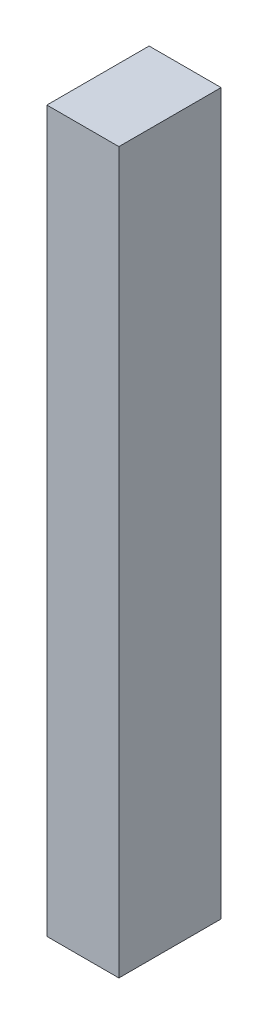
ISO-10303-21;
HEADER;
FILE_DESCRIPTION(('STEP AP214'),'2;1');
FILE_NAME('part.step','',(''),(''),'','','');
FILE_SCHEMA(('AUTOMOTIVE_DESIGN { 1 0 10303 214 1 1 1 1 }'));
ENDSEC;
DATA;
#1=APPLICATION_CONTEXT('core data for automotive mechanical design processes');
#2=APPLICATION_PROTOCOL_DEFINITION('international standard','automotive_design',2000,#1);
#3=PRODUCT_CONTEXT('',#1,'mechanical');
#4=PRODUCT('Part','Part','',(#3));
#5=PRODUCT_RELATED_PRODUCT_CATEGORY('part','',(#4));
#6=PRODUCT_DEFINITION_FORMATION('','',#4);
#7=PRODUCT_DEFINITION_CONTEXT('part definition',#1,'design');
#8=PRODUCT_DEFINITION('design','',#6,#7);
#9=PRODUCT_DEFINITION_SHAPE('','',#8);
#10=(LENGTH_UNIT() NAMED_UNIT(*) SI_UNIT(.MILLI.,.METRE.));
#11=(NAMED_UNIT(*) PLANE_ANGLE_UNIT() SI_UNIT($,.RADIAN.));
#12=(NAMED_UNIT(*) SI_UNIT($,.STERADIAN.) SOLID_ANGLE_UNIT());
#13=UNCERTAINTY_MEASURE_WITH_UNIT(LENGTH_MEASURE(1.E-05),#10,'distance_accuracy_value','');
#14=(GEOMETRIC_REPRESENTATION_CONTEXT(3) GLOBAL_UNCERTAINTY_ASSIGNED_CONTEXT((#13)) GLOBAL_UNIT_ASSIGNED_CONTEXT((#10,
#11,#12)) REPRESENTATION_CONTEXT('',''));
#15=CARTESIAN_POINT('',(0.,0.,0.));
#16=DIRECTION('',(0.,0.,1.));
#17=DIRECTION('',(1.,0.,0.));
#18=AXIS2_PLACEMENT_3D('',#15,#16,#17);
#19=CARTESIAN_POINT('',(0.,0.,28.4));
#20=DIRECTION('',(1.,0.,0.));
#21=DIRECTION('',(0.,0.,-1.));
#22=AXIS2_PLACEMENT_3D('',#19,#20,#21);
#23=PLANE('',#22);
#24=DIRECTION('',(0.,-1.,0.));
#25=VECTOR('',#24,1.);
#26=CARTESIAN_POINT('',(0.,0.,0.));
#27=LINE('',#26,#25);
#28=CARTESIAN_POINT('',(0.,200.,0.));
#29=VERTEX_POINT('',#28);
#30=CARTESIAN_POINT('',(0.,0.,0.));
#31=VERTEX_POINT('',#30);
#32=EDGE_CURVE('E96',#29,#31,#27,.T.);
#33=ORIENTED_EDGE('',*,*,#32,.T.);
#34=DIRECTION('',(0.,0.,-1.));
#35=VECTOR('',#34,1.);
#36=CARTESIAN_POINT('',(0.,0.,28.4));
#37=LINE('',#36,#35);
#38=CARTESIAN_POINT('',(0.,0.,28.4));
#39=VERTEX_POINT('',#38);
#40=EDGE_CURVE('E11',#39,#31,#37,.T.);
#41=ORIENTED_EDGE('',*,*,#40,.F.);
#42=DIRECTION('',(0.,-1.,0.));
#43=VECTOR('',#42,1.);
#44=CARTESIAN_POINT('',(0.,0.,28.4));
#45=LINE('',#44,#43);
#46=CARTESIAN_POINT('',(0.,200.,28.4));
#47=VERTEX_POINT('',#46);
#48=EDGE_CURVE('E84',#47,#39,#45,.T.);
#49=ORIENTED_EDGE('',*,*,#48,.F.);
#50=DIRECTION('',(0.,0.,-1.));
#51=VECTOR('',#50,1.);
#52=CARTESIAN_POINT('',(0.,200.,28.4));
#53=LINE('',#52,#51);
#54=EDGE_CURVE('E92',#47,#29,#53,.T.);
#55=ORIENTED_EDGE('',*,*,#54,.T.);
#56=EDGE_LOOP('',(#33,#41,#49,#55));
#57=FACE_BOUND('',#56,.T.);
#58=ADVANCED_FACE('F33',(#57),#23,.F.);
#59=CARTESIAN_POINT('',(0.,0.,28.4));
#60=DIRECTION('',(0.,1.,0.));
#61=DIRECTION('',(0.,0.,1.));
#62=AXIS2_PLACEMENT_3D('',#59,#60,#61);
#63=PLANE('',#62);
#64=DIRECTION('',(1.,0.,0.));
#65=VECTOR('',#64,1.);
#66=CARTESIAN_POINT('',(0.,0.,0.));
#67=LINE('',#66,#65);
#68=CARTESIAN_POINT('',(20.,0.,0.));
#69=VERTEX_POINT('',#68);
#70=EDGE_CURVE('E88',#31,#69,#67,.T.);
#71=ORIENTED_EDGE('',*,*,#70,.T.);
#72=DIRECTION('',(0.,0.,-1.));
#73=VECTOR('',#72,1.);
#74=CARTESIAN_POINT('',(20.,0.,28.4));
#75=LINE('',#74,#73);
#76=CARTESIAN_POINT('',(20.,0.,28.4));
#77=VERTEX_POINT('',#76);
#78=EDGE_CURVE('E41',#77,#69,#75,.T.);
#79=ORIENTED_EDGE('',*,*,#78,.F.);
#80=DIRECTION('',(1.,0.,0.));
#81=VECTOR('',#80,1.);
#82=CARTESIAN_POINT('',(0.,0.,28.4));
#83=LINE('',#82,#81);
#84=EDGE_CURVE('E79',#39,#77,#83,.T.);
#85=ORIENTED_EDGE('',*,*,#84,.F.);
#86=ORIENTED_EDGE('',*,*,#40,.T.);
#87=EDGE_LOOP('',(#71,#79,#85,#86));
#88=FACE_BOUND('',#87,.T.);
#89=ADVANCED_FACE('F87',(#88),#63,.F.);
#90=CARTESIAN_POINT('',(20.,0.,28.4));
#91=DIRECTION('',(-1.,0.,0.));
#92=DIRECTION('',(0.,0.,1.));
#93=AXIS2_PLACEMENT_3D('',#90,#91,#92);
#94=PLANE('',#93);
#95=DIRECTION('',(0.,1.,0.));
#96=VECTOR('',#95,1.);
#97=CARTESIAN_POINT('',(20.,0.,0.));
#98=LINE('',#97,#96);
#99=CARTESIAN_POINT('',(20.,200.,0.));
#100=VERTEX_POINT('',#99);
#101=EDGE_CURVE('E66',#69,#100,#98,.T.);
#102=ORIENTED_EDGE('',*,*,#101,.T.);
#103=DIRECTION('',(0.,0.,-1.));
#104=VECTOR('',#103,1.);
#105=CARTESIAN_POINT('',(20.,200.,28.4));
#106=LINE('',#105,#104);
#107=CARTESIAN_POINT('',(20.,200.,28.4));
#108=VERTEX_POINT('',#107);
#109=EDGE_CURVE('E89',#108,#100,#106,.T.);
#110=ORIENTED_EDGE('',*,*,#109,.F.);
#111=DIRECTION('',(0.,1.,0.));
#112=VECTOR('',#111,1.);
#113=CARTESIAN_POINT('',(20.,0.,28.4));
#114=LINE('',#113,#112);
#115=EDGE_CURVE('E82',#77,#108,#114,.T.);
#116=ORIENTED_EDGE('',*,*,#115,.F.);
#117=ORIENTED_EDGE('',*,*,#78,.T.);
#118=EDGE_LOOP('',(#102,#110,#116,#117));
#119=FACE_BOUND('',#118,.T.);
#120=ADVANCED_FACE('F90',(#119),#94,.F.);
#121=CARTESIAN_POINT('',(0.,200.,28.4));
#122=DIRECTION('',(0.,-1.,0.));
#123=DIRECTION('',(0.,0.,-1.));
#124=AXIS2_PLACEMENT_3D('',#121,#122,#123);
#125=PLANE('',#124);
#126=DIRECTION('',(-1.,0.,0.));
#127=VECTOR('',#126,1.);
#128=CARTESIAN_POINT('',(0.,200.,0.));
#129=LINE('',#128,#127);
#130=EDGE_CURVE('E72',#100,#29,#129,.T.);
#131=ORIENTED_EDGE('',*,*,#130,.T.);
#132=ORIENTED_EDGE('',*,*,#54,.F.);
#133=DIRECTION('',(-1.,0.,0.));
#134=VECTOR('',#133,1.);
#135=CARTESIAN_POINT('',(0.,200.,28.4));
#136=LINE('',#135,#134);
#137=EDGE_CURVE('E49',#108,#47,#136,.T.);
#138=ORIENTED_EDGE('',*,*,#137,.F.);
#139=ORIENTED_EDGE('',*,*,#109,.T.);
#140=EDGE_LOOP('',(#131,#132,#138,#139));
#141=FACE_BOUND('',#140,.T.);
#142=ADVANCED_FACE('F103',(#141),#125,.F.);
#143=CARTESIAN_POINT('',(0.,0.,28.4));
#144=DIRECTION('',(0.,0.,-1.));
#145=DIRECTION('',(-1.,0.,0.));
#146=AXIS2_PLACEMENT_3D('',#143,#144,#145);
#147=PLANE('',#146);
#148=ORIENTED_EDGE('',*,*,#48,.T.);
#149=ORIENTED_EDGE('',*,*,#84,.T.);
#150=ORIENTED_EDGE('',*,*,#115,.T.);
#151=ORIENTED_EDGE('',*,*,#137,.T.);
#152=EDGE_LOOP('',(#148,#149,#150,#151));
#153=FACE_BOUND('',#152,.T.);
#154=ADVANCED_FACE('F80',(#153),#147,.F.);
#155=CARTESIAN_POINT('',(0.,0.,0.));
#156=DIRECTION('',(0.,0.,-1.));
#157=DIRECTION('',(-1.,0.,0.));
#158=AXIS2_PLACEMENT_3D('',#155,#156,#157);
#159=PLANE('',#158);
#160=ORIENTED_EDGE('',*,*,#32,.F.);
#161=ORIENTED_EDGE('',*,*,#130,.F.);
#162=ORIENTED_EDGE('',*,*,#101,.F.);
#163=ORIENTED_EDGE('',*,*,#70,.F.);
#164=EDGE_LOOP('',(#160,#161,#162,#163));
#165=FACE_BOUND('',#164,.T.);
#166=ADVANCED_FACE('F106',(#165),#159,.T.);
#167=CLOSED_SHELL('',(#58,#89,#120,#142,#154,#166));
#168=MANIFOLD_SOLID_BREP('B2',#167);
#169=ADVANCED_BREP_SHAPE_REPRESENTATION('',(#18,#168),#14);
#170=SHAPE_DEFINITION_REPRESENTATION(#9,#169);
ENDSEC;
END-ISO-10303-21;
